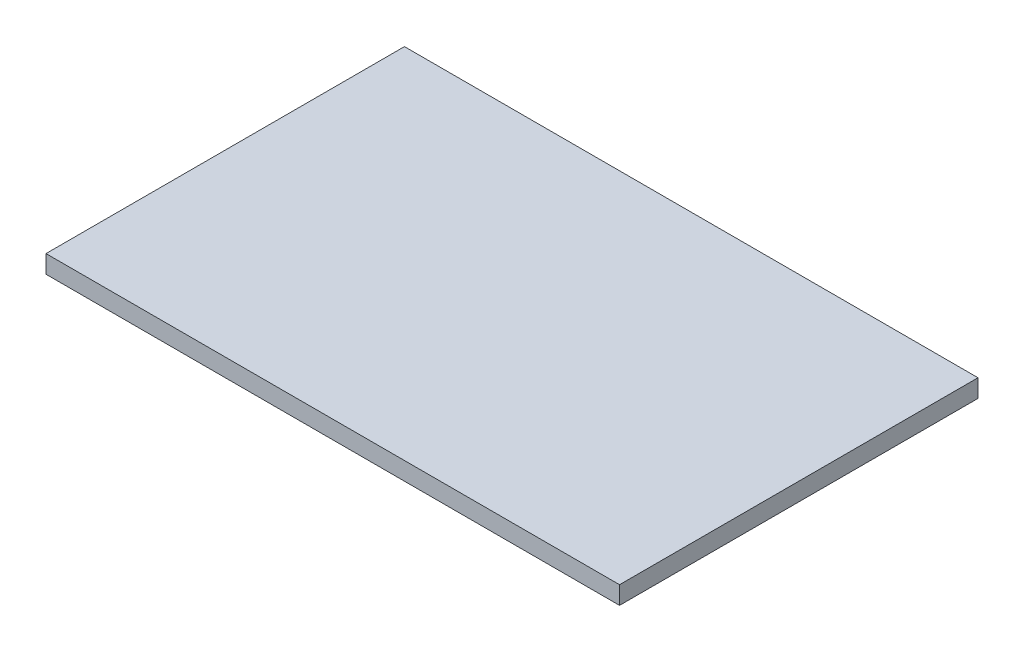
ISO-10303-21;
HEADER;
FILE_DESCRIPTION(('STEP AP214'),'2;1');
FILE_NAME('part.step','',(''),(''),'','','');
FILE_SCHEMA(('AUTOMOTIVE_DESIGN { 1 0 10303 214 1 1 1 1 }'));
ENDSEC;
DATA;
#1=APPLICATION_CONTEXT('core data for automotive mechanical design processes');
#2=APPLICATION_PROTOCOL_DEFINITION('international standard','automotive_design',2000,#1);
#3=PRODUCT_CONTEXT('',#1,'mechanical');
#4=PRODUCT('Part','Part','',(#3));
#5=PRODUCT_RELATED_PRODUCT_CATEGORY('part','',(#4));
#6=PRODUCT_DEFINITION_FORMATION('','',#4);
#7=PRODUCT_DEFINITION_CONTEXT('part definition',#1,'design');
#8=PRODUCT_DEFINITION('design','',#6,#7);
#9=PRODUCT_DEFINITION_SHAPE('','',#8);
#10=(LENGTH_UNIT() NAMED_UNIT(*) SI_UNIT(.MILLI.,.METRE.));
#11=(NAMED_UNIT(*) PLANE_ANGLE_UNIT() SI_UNIT($,.RADIAN.));
#12=(NAMED_UNIT(*) SI_UNIT($,.STERADIAN.) SOLID_ANGLE_UNIT());
#13=UNCERTAINTY_MEASURE_WITH_UNIT(LENGTH_MEASURE(1.E-05),#10,'distance_accuracy_value','');
#14=(GEOMETRIC_REPRESENTATION_CONTEXT(3) GLOBAL_UNCERTAINTY_ASSIGNED_CONTEXT((#13)) GLOBAL_UNIT_ASSIGNED_CONTEXT((#10,
#11,#12)) REPRESENTATION_CONTEXT('',''));
#15=CARTESIAN_POINT('',(0.,0.,0.));
#16=DIRECTION('',(0.,0.,1.));
#17=DIRECTION('',(1.,0.,0.));
#18=AXIS2_PLACEMENT_3D('',#15,#16,#17);
#19=CARTESIAN_POINT('',(-45.8454297000321,5.,22.007509989237));
#20=DIRECTION('',(1.,0.,0.));
#21=DIRECTION('',(0.,0.,-1.));
#22=AXIS2_PLACEMENT_3D('',#19,#20,#21);
#23=PLANE('',#22);
#24=DIRECTION('',(0.,0.,1.));
#25=VECTOR('',#24,1.);
#26=CARTESIAN_POINT('',(-45.8454297000321,0.,22.007509989237));
#27=LINE('',#26,#25);
#28=CARTESIAN_POINT('',(-45.8454297000321,0.,-77.992490010763));
#29=VERTEX_POINT('',#28);
#30=CARTESIAN_POINT('',(-45.8454297000321,0.,22.007509989237));
#31=VERTEX_POINT('',#30);
#32=EDGE_CURVE('E96',#29,#31,#27,.T.);
#33=ORIENTED_EDGE('',*,*,#32,.T.);
#34=DIRECTION('',(0.,-1.,0.));
#35=VECTOR('',#34,1.);
#36=CARTESIAN_POINT('',(-45.8454297000321,5.,22.007509989237));
#37=LINE('',#36,#35);
#38=CARTESIAN_POINT('',(-45.8454297000321,5.,22.007509989237));
#39=VERTEX_POINT('',#38);
#40=EDGE_CURVE('E11',#39,#31,#37,.T.);
#41=ORIENTED_EDGE('',*,*,#40,.F.);
#42=DIRECTION('',(0.,0.,1.));
#43=VECTOR('',#42,1.);
#44=CARTESIAN_POINT('',(-45.8454297000321,5.,22.007509989237));
#45=LINE('',#44,#43);
#46=CARTESIAN_POINT('',(-45.8454297000321,5.,-77.992490010763));
#47=VERTEX_POINT('',#46);
#48=EDGE_CURVE('E84',#47,#39,#45,.T.);
#49=ORIENTED_EDGE('',*,*,#48,.F.);
#50=DIRECTION('',(0.,-1.,0.));
#51=VECTOR('',#50,1.);
#52=CARTESIAN_POINT('',(-45.8454297000321,5.,-77.992490010763));
#53=LINE('',#52,#51);
#54=EDGE_CURVE('E92',#47,#29,#53,.T.);
#55=ORIENTED_EDGE('',*,*,#54,.T.);
#56=EDGE_LOOP('',(#33,#41,#49,#55));
#57=FACE_BOUND('',#56,.T.);
#58=ADVANCED_FACE('F33',(#57),#23,.F.);
#59=CARTESIAN_POINT('',(-45.8454297000321,5.,22.007509989237));
#60=DIRECTION('',(0.,0.,-1.));
#61=DIRECTION('',(-1.,0.,0.));
#62=AXIS2_PLACEMENT_3D('',#59,#60,#61);
#63=PLANE('',#62);
#64=DIRECTION('',(1.,0.,0.));
#65=VECTOR('',#64,1.);
#66=CARTESIAN_POINT('',(-45.8454297000321,0.,22.007509989237));
#67=LINE('',#66,#65);
#68=CARTESIAN_POINT('',(114.154570299968,0.,22.007509989237));
#69=VERTEX_POINT('',#68);
#70=EDGE_CURVE('E88',#31,#69,#67,.T.);
#71=ORIENTED_EDGE('',*,*,#70,.T.);
#72=DIRECTION('',(0.,-1.,0.));
#73=VECTOR('',#72,1.);
#74=CARTESIAN_POINT('',(114.154570299968,5.,22.007509989237));
#75=LINE('',#74,#73);
#76=CARTESIAN_POINT('',(114.154570299968,5.,22.007509989237));
#77=VERTEX_POINT('',#76);
#78=EDGE_CURVE('E41',#77,#69,#75,.T.);
#79=ORIENTED_EDGE('',*,*,#78,.F.);
#80=DIRECTION('',(1.,0.,0.));
#81=VECTOR('',#80,1.);
#82=CARTESIAN_POINT('',(-45.8454297000321,5.,22.007509989237));
#83=LINE('',#82,#81);
#84=EDGE_CURVE('E79',#39,#77,#83,.T.);
#85=ORIENTED_EDGE('',*,*,#84,.F.);
#86=ORIENTED_EDGE('',*,*,#40,.T.);
#87=EDGE_LOOP('',(#71,#79,#85,#86));
#88=FACE_BOUND('',#87,.T.);
#89=ADVANCED_FACE('F87',(#88),#63,.F.);
#90=CARTESIAN_POINT('',(114.154570299968,5.,22.007509989237));
#91=DIRECTION('',(-1.,0.,0.));
#92=DIRECTION('',(0.,0.,1.));
#93=AXIS2_PLACEMENT_3D('',#90,#91,#92);
#94=PLANE('',#93);
#95=DIRECTION('',(0.,0.,-1.));
#96=VECTOR('',#95,1.);
#97=CARTESIAN_POINT('',(114.154570299968,0.,22.007509989237));
#98=LINE('',#97,#96);
#99=CARTESIAN_POINT('',(114.154570299968,0.,-77.992490010763));
#100=VERTEX_POINT('',#99);
#101=EDGE_CURVE('E66',#69,#100,#98,.T.);
#102=ORIENTED_EDGE('',*,*,#101,.T.);
#103=DIRECTION('',(0.,-1.,0.));
#104=VECTOR('',#103,1.);
#105=CARTESIAN_POINT('',(114.154570299968,5.,-77.992490010763));
#106=LINE('',#105,#104);
#107=CARTESIAN_POINT('',(114.154570299968,5.,-77.992490010763));
#108=VERTEX_POINT('',#107);
#109=EDGE_CURVE('E89',#108,#100,#106,.T.);
#110=ORIENTED_EDGE('',*,*,#109,.F.);
#111=DIRECTION('',(0.,0.,-1.));
#112=VECTOR('',#111,1.);
#113=CARTESIAN_POINT('',(114.154570299968,5.,22.007509989237));
#114=LINE('',#113,#112);
#115=EDGE_CURVE('E82',#77,#108,#114,.T.);
#116=ORIENTED_EDGE('',*,*,#115,.F.);
#117=ORIENTED_EDGE('',*,*,#78,.T.);
#118=EDGE_LOOP('',(#102,#110,#116,#117));
#119=FACE_BOUND('',#118,.T.);
#120=ADVANCED_FACE('F90',(#119),#94,.F.);
#121=CARTESIAN_POINT('',(-45.8454297000321,5.,-77.992490010763));
#122=DIRECTION('',(0.,0.,1.));
#123=DIRECTION('',(1.,0.,0.));
#124=AXIS2_PLACEMENT_3D('',#121,#122,#123);
#125=PLANE('',#124);
#126=DIRECTION('',(-1.,0.,0.));
#127=VECTOR('',#126,1.);
#128=CARTESIAN_POINT('',(-45.8454297000321,0.,-77.992490010763));
#129=LINE('',#128,#127);
#130=EDGE_CURVE('E72',#100,#29,#129,.T.);
#131=ORIENTED_EDGE('',*,*,#130,.T.);
#132=ORIENTED_EDGE('',*,*,#54,.F.);
#133=DIRECTION('',(-1.,0.,0.));
#134=VECTOR('',#133,1.);
#135=CARTESIAN_POINT('',(-45.8454297000321,5.,-77.992490010763));
#136=LINE('',#135,#134);
#137=EDGE_CURVE('E49',#108,#47,#136,.T.);
#138=ORIENTED_EDGE('',*,*,#137,.F.);
#139=ORIENTED_EDGE('',*,*,#109,.T.);
#140=EDGE_LOOP('',(#131,#132,#138,#139));
#141=FACE_BOUND('',#140,.T.);
#142=ADVANCED_FACE('F103',(#141),#125,.F.);
#143=CARTESIAN_POINT('',(0.,5.,0.));
#144=DIRECTION('',(0.,-1.,0.));
#145=DIRECTION('',(0.,0.,-1.));
#146=AXIS2_PLACEMENT_3D('',#143,#144,#145);
#147=PLANE('',#146);
#148=ORIENTED_EDGE('',*,*,#48,.T.);
#149=ORIENTED_EDGE('',*,*,#84,.T.);
#150=ORIENTED_EDGE('',*,*,#115,.T.);
#151=ORIENTED_EDGE('',*,*,#137,.T.);
#152=EDGE_LOOP('',(#148,#149,#150,#151));
#153=FACE_BOUND('',#152,.T.);
#154=ADVANCED_FACE('F80',(#153),#147,.F.);
#155=CARTESIAN_POINT('',(0.,0.,0.));
#156=DIRECTION('',(0.,-1.,0.));
#157=DIRECTION('',(0.,0.,-1.));
#158=AXIS2_PLACEMENT_3D('',#155,#156,#157);
#159=PLANE('',#158);
#160=ORIENTED_EDGE('',*,*,#32,.F.);
#161=ORIENTED_EDGE('',*,*,#130,.F.);
#162=ORIENTED_EDGE('',*,*,#101,.F.);
#163=ORIENTED_EDGE('',*,*,#70,.F.);
#164=EDGE_LOOP('',(#160,#161,#162,#163));
#165=FACE_BOUND('',#164,.T.);
#166=ADVANCED_FACE('F106',(#165),#159,.T.);
#167=CLOSED_SHELL('',(#58,#89,#120,#142,#154,#166));
#168=MANIFOLD_SOLID_BREP('B2',#167);
#169=ADVANCED_BREP_SHAPE_REPRESENTATION('',(#18,#168),#14);
#170=SHAPE_DEFINITION_REPRESENTATION(#9,#169);
ENDSEC;
END-ISO-10303-21;
